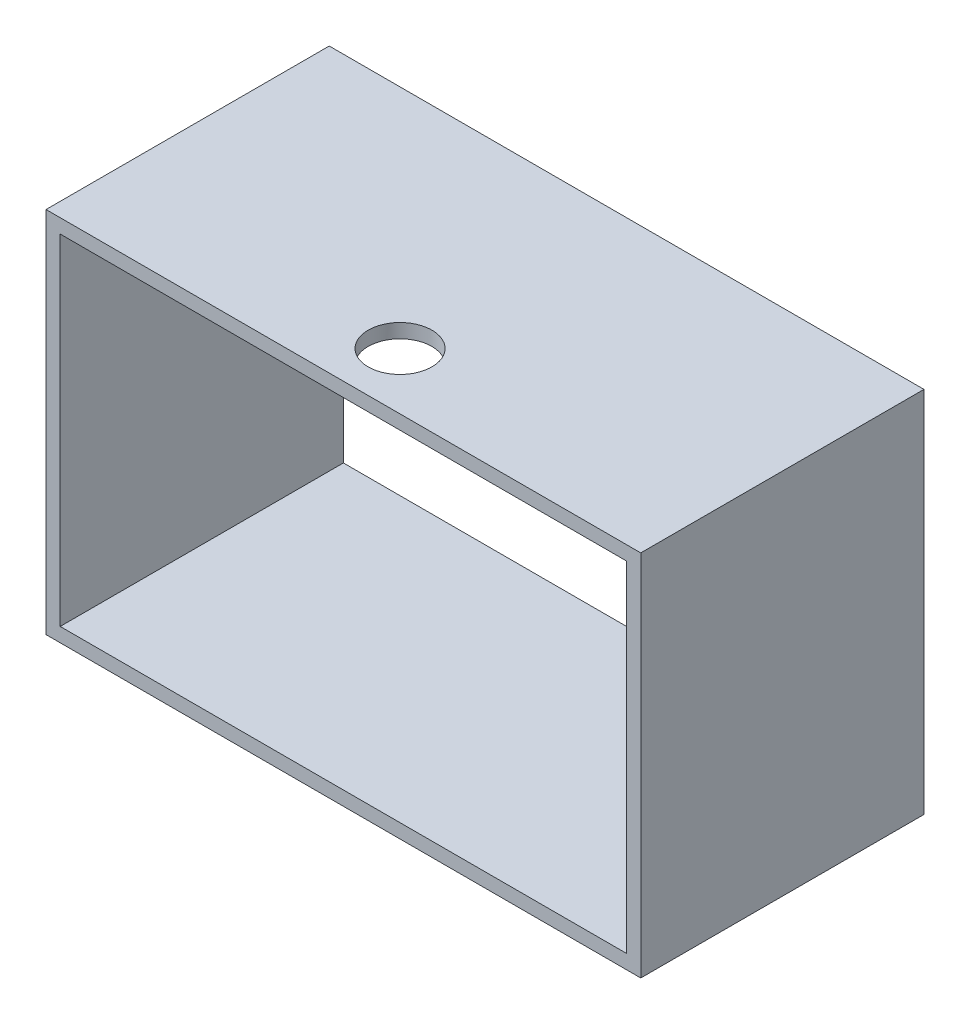
ISO-10303-21;
HEADER;
FILE_DESCRIPTION(('STEP AP214'),'2;1');
FILE_NAME('part.step','',(''),(''),'','','');
FILE_SCHEMA(('AUTOMOTIVE_DESIGN { 1 0 10303 214 1 1 1 1 }'));
ENDSEC;
DATA;
#1=APPLICATION_CONTEXT('core data for automotive mechanical design processes');
#2=APPLICATION_PROTOCOL_DEFINITION('international standard','automotive_design',2000,#1);
#3=PRODUCT_CONTEXT('',#1,'mechanical');
#4=PRODUCT('Part','Part','',(#3));
#5=PRODUCT_RELATED_PRODUCT_CATEGORY('part','',(#4));
#6=PRODUCT_DEFINITION_FORMATION('','',#4);
#7=PRODUCT_DEFINITION_CONTEXT('part definition',#1,'design');
#8=PRODUCT_DEFINITION('design','',#6,#7);
#9=PRODUCT_DEFINITION_SHAPE('','',#8);
#10=(LENGTH_UNIT() NAMED_UNIT(*) SI_UNIT(.MILLI.,.METRE.));
#11=(NAMED_UNIT(*) PLANE_ANGLE_UNIT() SI_UNIT($,.RADIAN.));
#12=(NAMED_UNIT(*) SI_UNIT($,.STERADIAN.) SOLID_ANGLE_UNIT());
#13=UNCERTAINTY_MEASURE_WITH_UNIT(LENGTH_MEASURE(1.E-05),#10,'distance_accuracy_value','');
#14=(GEOMETRIC_REPRESENTATION_CONTEXT(3) GLOBAL_UNCERTAINTY_ASSIGNED_CONTEXT((#13)) GLOBAL_UNIT_ASSIGNED_CONTEXT((#10,
#11,#12)) REPRESENTATION_CONTEXT('',''));
#15=CARTESIAN_POINT('',(0.,0.,0.));
#16=DIRECTION('',(0.,0.,1.));
#17=DIRECTION('',(1.,0.,0.));
#18=AXIS2_PLACEMENT_3D('',#15,#16,#17);
#19=CARTESIAN_POINT('',(0.,0.,0.));
#20=DIRECTION('',(0.,0.,-1.));
#21=DIRECTION('',(-1.,0.,0.));
#22=AXIS2_PLACEMENT_3D('',#19,#20,#21);
#23=PLANE('',#22);
#24=DIRECTION('',(0.,-1.,0.));
#25=VECTOR('',#24,1.);
#26=CARTESIAN_POINT('',(0.,0.,0.));
#27=LINE('',#26,#25);
#28=CARTESIAN_POINT('',(0.,165.1,0.));
#29=VERTEX_POINT('',#28);
#30=CARTESIAN_POINT('',(0.,0.,0.));
#31=VERTEX_POINT('',#30);
#32=EDGE_CURVE('E130',#29,#31,#27,.T.);
#33=ORIENTED_EDGE('',*,*,#32,.F.);
#34=DIRECTION('',(-1.,0.,0.));
#35=VECTOR('',#34,1.);
#36=CARTESIAN_POINT('',(0.,165.1,0.));
#37=LINE('',#36,#35);
#38=CARTESIAN_POINT('',(266.7,165.1,0.));
#39=VERTEX_POINT('',#38);
#40=EDGE_CURVE('E141',#39,#29,#37,.T.);
#41=ORIENTED_EDGE('',*,*,#40,.F.);
#42=DIRECTION('',(0.,1.,0.));
#43=VECTOR('',#42,1.);
#44=CARTESIAN_POINT('',(266.7,0.,0.));
#45=LINE('',#44,#43);
#46=CARTESIAN_POINT('',(266.7,0.,0.));
#47=VERTEX_POINT('',#46);
#48=EDGE_CURVE('E145',#47,#39,#45,.T.);
#49=ORIENTED_EDGE('',*,*,#48,.F.);
#50=DIRECTION('',(1.,0.,0.));
#51=VECTOR('',#50,1.);
#52=CARTESIAN_POINT('',(0.,0.,0.));
#53=LINE('',#52,#51);
#54=EDGE_CURVE('E149',#31,#47,#53,.T.);
#55=ORIENTED_EDGE('',*,*,#54,.F.);
#56=EDGE_LOOP('',(#33,#41,#49,#55));
#57=FACE_BOUND('',#56,.T.);
#58=DIRECTION('',(0.,-1.,0.));
#59=VECTOR('',#58,1.);
#60=CARTESIAN_POINT('',(6.35,6.35,0.));
#61=LINE('',#60,#59);
#62=CARTESIAN_POINT('',(6.35,158.75,0.));
#63=VERTEX_POINT('',#62);
#64=CARTESIAN_POINT('',(6.35,6.35,0.));
#65=VERTEX_POINT('',#64);
#66=EDGE_CURVE('E166',#63,#65,#61,.T.);
#67=ORIENTED_EDGE('',*,*,#66,.T.);
#68=DIRECTION('',(1.,0.,0.));
#69=VECTOR('',#68,1.);
#70=CARTESIAN_POINT('',(6.35,6.35,0.));
#71=LINE('',#70,#69);
#72=CARTESIAN_POINT('',(260.35,6.35,0.));
#73=VERTEX_POINT('',#72);
#74=EDGE_CURVE('E178',#65,#73,#71,.T.);
#75=ORIENTED_EDGE('',*,*,#74,.T.);
#76=DIRECTION('',(0.,1.,0.));
#77=VECTOR('',#76,1.);
#78=CARTESIAN_POINT('',(260.35,6.35,0.));
#79=LINE('',#78,#77);
#80=CARTESIAN_POINT('',(260.35,158.75,0.));
#81=VERTEX_POINT('',#80);
#82=EDGE_CURVE('E174',#73,#81,#79,.T.);
#83=ORIENTED_EDGE('',*,*,#82,.T.);
#84=DIRECTION('',(-1.,0.,0.));
#85=VECTOR('',#84,1.);
#86=CARTESIAN_POINT('',(6.35,158.75,0.));
#87=LINE('',#86,#85);
#88=EDGE_CURVE('E170',#81,#63,#87,.T.);
#89=ORIENTED_EDGE('',*,*,#88,.T.);
#90=EDGE_LOOP('',(#67,#75,#83,#89));
#91=FACE_BOUND('',#90,.T.);
#92=ADVANCED_FACE('F47',(#57,#91),#23,.T.);
#93=CARTESIAN_POINT('',(0.,0.,215.9));
#94=DIRECTION('',(1.,0.,0.));
#95=DIRECTION('',(0.,0.,-1.));
#96=AXIS2_PLACEMENT_3D('',#93,#94,#95);
#97=PLANE('',#96);
#98=DIRECTION('',(0.,0.,-1.));
#99=VECTOR('',#98,1.);
#100=CARTESIAN_POINT('',(0.,0.,215.9));
#101=LINE('',#100,#99);
#102=CARTESIAN_POINT('',(0.,0.,127.));
#103=VERTEX_POINT('',#102);
#104=EDGE_CURVE('E56',#103,#31,#101,.T.);
#105=ORIENTED_EDGE('',*,*,#104,.F.);
#106=DIRECTION('',(0.,1.,0.));
#107=VECTOR('',#106,1.);
#108=CARTESIAN_POINT('',(0.,165.1,127.));
#109=LINE('',#108,#107);
#110=CARTESIAN_POINT('',(0.,165.1,127.));
#111=VERTEX_POINT('',#110);
#112=EDGE_CURVE('E110',#103,#111,#109,.T.);
#113=ORIENTED_EDGE('',*,*,#112,.T.);
#114=DIRECTION('',(0.,0.,-1.));
#115=VECTOR('',#114,1.);
#116=CARTESIAN_POINT('',(0.,165.1,215.9));
#117=LINE('',#116,#115);
#118=EDGE_CURVE('E138',#111,#29,#117,.T.);
#119=ORIENTED_EDGE('',*,*,#118,.T.);
#120=ORIENTED_EDGE('',*,*,#32,.T.);
#121=EDGE_LOOP('',(#105,#113,#119,#120));
#122=FACE_BOUND('',#121,.T.);
#123=ADVANCED_FACE('F49',(#122),#97,.F.);
#124=CARTESIAN_POINT('',(0.,0.,215.9));
#125=DIRECTION('',(0.,1.,0.));
#126=DIRECTION('',(0.,0.,1.));
#127=AXIS2_PLACEMENT_3D('',#124,#125,#126);
#128=PLANE('',#127);
#129=DIRECTION('',(0.,0.,-1.));
#130=VECTOR('',#129,1.);
#131=CARTESIAN_POINT('',(266.7,0.,215.9));
#132=LINE('',#131,#130);
#133=CARTESIAN_POINT('',(266.7,0.,127.));
#134=VERTEX_POINT('',#133);
#135=EDGE_CURVE('E125',#134,#47,#132,.T.);
#136=ORIENTED_EDGE('',*,*,#135,.F.);
#137=DIRECTION('',(1.,0.,0.));
#138=VECTOR('',#137,1.);
#139=CARTESIAN_POINT('',(0.,0.,127.));
#140=LINE('',#139,#138);
#141=EDGE_CURVE('E113',#103,#134,#140,.T.);
#142=ORIENTED_EDGE('',*,*,#141,.F.);
#143=ORIENTED_EDGE('',*,*,#104,.T.);
#144=ORIENTED_EDGE('',*,*,#54,.T.);
#145=EDGE_LOOP('',(#136,#142,#143,#144));
#146=FACE_BOUND('',#145,.T.);
#147=ADVANCED_FACE('F122',(#146),#128,.F.);
#148=CARTESIAN_POINT('',(266.7,0.,215.9));
#149=DIRECTION('',(-1.,0.,0.));
#150=DIRECTION('',(0.,0.,1.));
#151=AXIS2_PLACEMENT_3D('',#148,#149,#150);
#152=PLANE('',#151);
#153=DIRECTION('',(0.,0.,-1.));
#154=VECTOR('',#153,1.);
#155=CARTESIAN_POINT('',(266.7,165.1,215.9));
#156=LINE('',#155,#154);
#157=CARTESIAN_POINT('',(266.7,165.1,127.));
#158=VERTEX_POINT('',#157);
#159=EDGE_CURVE('E133',#158,#39,#156,.T.);
#160=ORIENTED_EDGE('',*,*,#159,.F.);
#161=DIRECTION('',(0.,1.,0.));
#162=VECTOR('',#161,1.);
#163=CARTESIAN_POINT('',(266.7,165.1,127.));
#164=LINE('',#163,#162);
#165=EDGE_CURVE('E63',#134,#158,#164,.T.);
#166=ORIENTED_EDGE('',*,*,#165,.F.);
#167=ORIENTED_EDGE('',*,*,#135,.T.);
#168=ORIENTED_EDGE('',*,*,#48,.T.);
#169=EDGE_LOOP('',(#160,#166,#167,#168));
#170=FACE_BOUND('',#169,.T.);
#171=ADVANCED_FACE('F209',(#170),#152,.F.);
#172=CARTESIAN_POINT('',(0.,165.1,215.9));
#173=DIRECTION('',(0.,-1.,0.));
#174=DIRECTION('',(0.,0.,-1.));
#175=AXIS2_PLACEMENT_3D('',#172,#173,#174);
#176=PLANE('',#175);
#177=CARTESIAN_POINT('',(133.35,165.1,101.6));
#178=DIRECTION('',(0.,1.,0.));
#179=DIRECTION('',(0.,0.,1.));
#180=AXIS2_PLACEMENT_3D('',#177,#178,#179);
#181=CIRCLE('',#180,14.2875);
#182=CARTESIAN_POINT('',(133.35,165.1,115.8875));
#183=VERTEX_POINT('',#182);
#184=EDGE_CURVE('E193',#183,#183,#181,.T.);
#185=ORIENTED_EDGE('',*,*,#184,.F.);
#186=EDGE_LOOP('',(#185));
#187=FACE_BOUND('',#186,.T.);
#188=ORIENTED_EDGE('',*,*,#118,.F.);
#189=DIRECTION('',(1.,0.,0.));
#190=VECTOR('',#189,1.);
#191=CARTESIAN_POINT('',(0.,165.1,127.));
#192=LINE('',#191,#190);
#193=EDGE_CURVE('E114',#111,#158,#192,.T.);
#194=ORIENTED_EDGE('',*,*,#193,.T.);
#195=ORIENTED_EDGE('',*,*,#159,.T.);
#196=ORIENTED_EDGE('',*,*,#40,.T.);
#197=EDGE_LOOP('',(#188,#194,#195,#196));
#198=FACE_BOUND('',#197,.T.);
#199=ADVANCED_FACE('F205',(#187,#198),#176,.F.);
#200=CARTESIAN_POINT('',(6.35,6.35,215.9));
#201=DIRECTION('',(0.,1.,0.));
#202=DIRECTION('',(0.,0.,1.));
#203=AXIS2_PLACEMENT_3D('',#200,#201,#202);
#204=PLANE('',#203);
#205=DIRECTION('',(-1.,0.,0.));
#206=VECTOR('',#205,1.);
#207=CARTESIAN_POINT('',(6.35,6.35,127.));
#208=LINE('',#207,#206);
#209=CARTESIAN_POINT('',(260.35,6.35,127.));
#210=VERTEX_POINT('',#209);
#211=CARTESIAN_POINT('',(6.35,6.35,127.));
#212=VERTEX_POINT('',#211);
#213=EDGE_CURVE('E70',#210,#212,#208,.T.);
#214=ORIENTED_EDGE('',*,*,#213,.F.);
#215=DIRECTION('',(0.,0.,-1.));
#216=VECTOR('',#215,1.);
#217=CARTESIAN_POINT('',(260.35,6.35,215.9));
#218=LINE('',#217,#216);
#219=EDGE_CURVE('E154',#210,#73,#218,.T.);
#220=ORIENTED_EDGE('',*,*,#219,.T.);
#221=ORIENTED_EDGE('',*,*,#74,.F.);
#222=DIRECTION('',(0.,0.,-1.));
#223=VECTOR('',#222,1.);
#224=CARTESIAN_POINT('',(6.35,6.35,215.9));
#225=LINE('',#224,#223);
#226=EDGE_CURVE('E163',#212,#65,#225,.T.);
#227=ORIENTED_EDGE('',*,*,#226,.F.);
#228=EDGE_LOOP('',(#214,#220,#221,#227));
#229=FACE_BOUND('',#228,.T.);
#230=ADVANCED_FACE('F208',(#229),#204,.T.);
#231=CARTESIAN_POINT('',(260.35,6.35,215.9));
#232=DIRECTION('',(-1.,0.,0.));
#233=DIRECTION('',(0.,0.,1.));
#234=AXIS2_PLACEMENT_3D('',#231,#232,#233);
#235=PLANE('',#234);
#236=DIRECTION('',(0.,-1.,0.));
#237=VECTOR('',#236,1.);
#238=CARTESIAN_POINT('',(260.35,6.35,127.));
#239=LINE('',#238,#237);
#240=CARTESIAN_POINT('',(260.35,158.75,127.));
#241=VERTEX_POINT('',#240);
#242=EDGE_CURVE('E184',#241,#210,#239,.T.);
#243=ORIENTED_EDGE('',*,*,#242,.F.);
#244=DIRECTION('',(0.,0.,-1.));
#245=VECTOR('',#244,1.);
#246=CARTESIAN_POINT('',(260.35,158.75,215.9));
#247=LINE('',#246,#245);
#248=EDGE_CURVE('E157',#241,#81,#247,.T.);
#249=ORIENTED_EDGE('',*,*,#248,.T.);
#250=ORIENTED_EDGE('',*,*,#82,.F.);
#251=ORIENTED_EDGE('',*,*,#219,.F.);
#252=EDGE_LOOP('',(#243,#249,#250,#251));
#253=FACE_BOUND('',#252,.T.);
#254=ADVANCED_FACE('F230',(#253),#235,.T.);
#255=CARTESIAN_POINT('',(6.35,158.75,215.9));
#256=DIRECTION('',(0.,-1.,0.));
#257=DIRECTION('',(0.,0.,-1.));
#258=AXIS2_PLACEMENT_3D('',#255,#256,#257);
#259=PLANE('',#258);
#260=CARTESIAN_POINT('',(133.35,158.75,101.6));
#261=DIRECTION('',(0.,-1.,0.));
#262=DIRECTION('',(0.,0.,-1.));
#263=AXIS2_PLACEMENT_3D('',#260,#261,#262);
#264=CIRCLE('',#263,14.2875);
#265=CARTESIAN_POINT('',(133.35,158.75,87.3125));
#266=VERTEX_POINT('',#265);
#267=EDGE_CURVE('E195',#266,#266,#264,.F.);
#268=ORIENTED_EDGE('',*,*,#267,.T.);
#269=EDGE_LOOP('',(#268));
#270=FACE_BOUND('',#269,.T.);
#271=DIRECTION('',(1.,0.,0.));
#272=VECTOR('',#271,1.);
#273=CARTESIAN_POINT('',(6.35,158.75,127.));
#274=LINE('',#273,#272);
#275=CARTESIAN_POINT('',(6.35,158.75,127.));
#276=VERTEX_POINT('',#275);
#277=EDGE_CURVE('E187',#276,#241,#274,.T.);
#278=ORIENTED_EDGE('',*,*,#277,.F.);
#279=DIRECTION('',(0.,0.,-1.));
#280=VECTOR('',#279,1.);
#281=CARTESIAN_POINT('',(6.35,158.75,215.9));
#282=LINE('',#281,#280);
#283=EDGE_CURVE('E160',#276,#63,#282,.T.);
#284=ORIENTED_EDGE('',*,*,#283,.T.);
#285=ORIENTED_EDGE('',*,*,#88,.F.);
#286=ORIENTED_EDGE('',*,*,#248,.F.);
#287=EDGE_LOOP('',(#278,#284,#285,#286));
#288=FACE_BOUND('',#287,.T.);
#289=ADVANCED_FACE('F234',(#270,#288),#259,.T.);
#290=CARTESIAN_POINT('',(6.35,6.35,215.9));
#291=DIRECTION('',(1.,0.,0.));
#292=DIRECTION('',(0.,0.,-1.));
#293=AXIS2_PLACEMENT_3D('',#290,#291,#292);
#294=PLANE('',#293);
#295=DIRECTION('',(0.,1.,0.));
#296=VECTOR('',#295,1.);
#297=CARTESIAN_POINT('',(6.35,6.35,127.));
#298=LINE('',#297,#296);
#299=EDGE_CURVE('E11',#212,#276,#298,.T.);
#300=ORIENTED_EDGE('',*,*,#299,.F.);
#301=ORIENTED_EDGE('',*,*,#226,.T.);
#302=ORIENTED_EDGE('',*,*,#66,.F.);
#303=ORIENTED_EDGE('',*,*,#283,.F.);
#304=EDGE_LOOP('',(#300,#301,#302,#303));
#305=FACE_BOUND('',#304,.T.);
#306=ADVANCED_FACE('F238',(#305),#294,.T.);
#307=CARTESIAN_POINT('',(0.,165.1,127.));
#308=DIRECTION('',(0.,0.,-1.));
#309=DIRECTION('',(-1.,0.,0.));
#310=AXIS2_PLACEMENT_3D('',#307,#308,#309);
#311=PLANE('',#310);
#312=ORIENTED_EDGE('',*,*,#213,.T.);
#313=ORIENTED_EDGE('',*,*,#299,.T.);
#314=ORIENTED_EDGE('',*,*,#277,.T.);
#315=ORIENTED_EDGE('',*,*,#242,.T.);
#316=EDGE_LOOP('',(#312,#313,#314,#315));
#317=FACE_BOUND('',#316,.T.);
#318=ORIENTED_EDGE('',*,*,#165,.T.);
#319=ORIENTED_EDGE('',*,*,#193,.F.);
#320=ORIENTED_EDGE('',*,*,#112,.F.);
#321=ORIENTED_EDGE('',*,*,#141,.T.);
#322=EDGE_LOOP('',(#318,#319,#320,#321));
#323=FACE_BOUND('',#322,.T.);
#324=ADVANCED_FACE('F112',(#317,#323),#311,.F.);
#325=CARTESIAN_POINT('',(133.35,-0.001000000000001,101.6));
#326=DIRECTION('',(0.,1.,0.));
#327=DIRECTION('',(0.,0.,1.));
#328=AXIS2_PLACEMENT_3D('',#325,#326,#327);
#329=CYLINDRICAL_SURFACE('',#328,14.2875);
#330=ORIENTED_EDGE('',*,*,#267,.F.);
#331=EDGE_LOOP('',(#330));
#332=FACE_BOUND('',#331,.T.);
#333=ORIENTED_EDGE('',*,*,#184,.T.);
#334=EDGE_LOOP('',(#333));
#335=FACE_BOUND('',#334,.T.);
#336=ADVANCED_FACE('F203',(#332,#335),#329,.F.);
#337=CLOSED_SHELL('',(#92,#123,#147,#171,#199,#230,#254,#289,#306,#324,#336));
#338=MANIFOLD_SOLID_BREP('B2',#337);
#339=ADVANCED_BREP_SHAPE_REPRESENTATION('',(#18,#338),#14);
#340=SHAPE_DEFINITION_REPRESENTATION(#9,#339);
ENDSEC;
END-ISO-10303-21;
